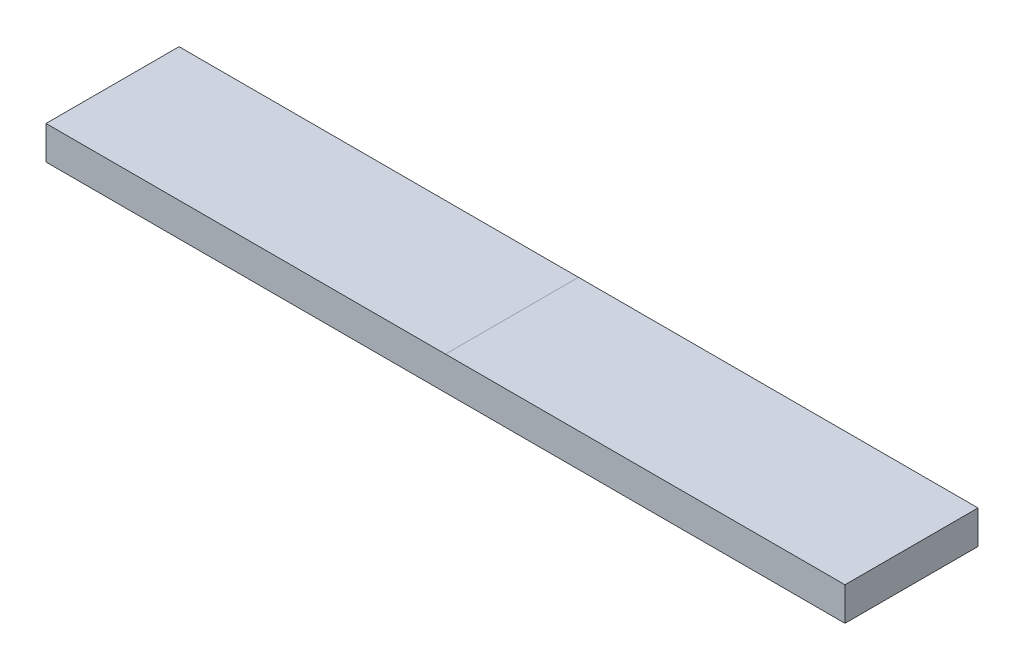
ISO-10303-21;
HEADER;
FILE_DESCRIPTION(('STEP AP214'),'2;1');
FILE_NAME('part.step','',(''),(''),'','','');
FILE_SCHEMA(('AUTOMOTIVE_DESIGN { 1 0 10303 214 1 1 1 1 }'));
ENDSEC;
DATA;
#1=APPLICATION_CONTEXT('core data for automotive mechanical design processes');
#2=APPLICATION_PROTOCOL_DEFINITION('international standard','automotive_design',2000,#1);
#3=PRODUCT_CONTEXT('',#1,'mechanical');
#4=PRODUCT('Part','Part','',(#3));
#5=PRODUCT_RELATED_PRODUCT_CATEGORY('part','',(#4));
#6=PRODUCT_DEFINITION_FORMATION('','',#4);
#7=PRODUCT_DEFINITION_CONTEXT('part definition',#1,'design');
#8=PRODUCT_DEFINITION('design','',#6,#7);
#9=PRODUCT_DEFINITION_SHAPE('','',#8);
#10=(LENGTH_UNIT() NAMED_UNIT(*) SI_UNIT(.MILLI.,.METRE.));
#11=(NAMED_UNIT(*) PLANE_ANGLE_UNIT() SI_UNIT($,.RADIAN.));
#12=(NAMED_UNIT(*) SI_UNIT($,.STERADIAN.) SOLID_ANGLE_UNIT());
#13=UNCERTAINTY_MEASURE_WITH_UNIT(LENGTH_MEASURE(1.E-05),#10,'distance_accuracy_value','');
#14=(GEOMETRIC_REPRESENTATION_CONTEXT(3) GLOBAL_UNCERTAINTY_ASSIGNED_CONTEXT((#13)) GLOBAL_UNIT_ASSIGNED_CONTEXT((#10,
#11,#12)) REPRESENTATION_CONTEXT('',''));
#15=CARTESIAN_POINT('',(0.,0.,0.));
#16=DIRECTION('',(0.,0.,1.));
#17=DIRECTION('',(1.,0.,0.));
#18=AXIS2_PLACEMENT_3D('',#15,#16,#17);
#19=CARTESIAN_POINT('',(76.2,3.1877,12.6873));
#20=DIRECTION('',(0.,1.,0.));
#21=DIRECTION('',(0.,0.,1.));
#22=AXIS2_PLACEMENT_3D('',#19,#20,#21);
#23=PLANE('',#22);
#24=DIRECTION('',(-1.,0.,0.));
#25=VECTOR('',#24,1.);
#26=CARTESIAN_POINT('',(76.2,3.1877,12.6873));
#27=LINE('',#26,#25);
#28=CARTESIAN_POINT('',(0.,3.1877,12.6873));
#29=VERTEX_POINT('',#28);
#30=CARTESIAN_POINT('',(-76.2,3.1877,12.6873));
#31=VERTEX_POINT('',#30);
#32=EDGE_CURVE('E104',#29,#31,#27,.T.);
#33=ORIENTED_EDGE('',*,*,#32,.F.);
#34=DIRECTION('',(0.,0.,-1.));
#35=VECTOR('',#34,1.);
#36=CARTESIAN_POINT('',(0.,3.1877,12.6873));
#37=LINE('',#36,#35);
#38=CARTESIAN_POINT('',(0.,3.1877,-12.6873));
#39=VERTEX_POINT('',#38);
#40=EDGE_CURVE('E12',#29,#39,#37,.T.);
#41=ORIENTED_EDGE('',*,*,#40,.T.);
#42=DIRECTION('',(-1.,0.,0.));
#43=VECTOR('',#42,1.);
#44=CARTESIAN_POINT('',(76.2,3.1877,-12.6873));
#45=LINE('',#44,#43);
#46=CARTESIAN_POINT('',(-76.2,3.1877,-12.6873));
#47=VERTEX_POINT('',#46);
#48=EDGE_CURVE('E103',#39,#47,#45,.T.);
#49=ORIENTED_EDGE('',*,*,#48,.T.);
#50=DIRECTION('',(0.,0.,-1.));
#51=VECTOR('',#50,1.);
#52=CARTESIAN_POINT('',(-76.2,3.1877,12.6873));
#53=LINE('',#52,#51);
#54=EDGE_CURVE('E131',#31,#47,#53,.T.);
#55=ORIENTED_EDGE('',*,*,#54,.F.);
#56=EDGE_LOOP('',(#33,#41,#49,#55));
#57=FACE_BOUND('',#56,.T.);
#58=ADVANCED_FACE('F43',(#57),#23,.T.);
#59=CARTESIAN_POINT('',(76.2,-3.1877,12.6873));
#60=DIRECTION('',(0.,1.,0.));
#61=DIRECTION('',(0.,0.,1.));
#62=AXIS2_PLACEMENT_3D('',#59,#60,#61);
#63=PLANE('',#62);
#64=DIRECTION('',(-1.,0.,0.));
#65=VECTOR('',#64,1.);
#66=CARTESIAN_POINT('',(76.2,-3.1877,12.6873));
#67=LINE('',#66,#65);
#68=CARTESIAN_POINT('',(63.5,-3.1877,12.6873));
#69=VERTEX_POINT('',#68);
#70=CARTESIAN_POINT('',(-63.4999999999999,-3.1877,12.6873));
#71=VERTEX_POINT('',#70);
#72=EDGE_CURVE('E138',#69,#71,#67,.T.);
#73=ORIENTED_EDGE('',*,*,#72,.T.);
#74=DIRECTION('',(0.,0.,-1.));
#75=VECTOR('',#74,1.);
#76=CARTESIAN_POINT('',(-63.5,-3.1877,12.6873));
#77=LINE('',#76,#75);
#78=CARTESIAN_POINT('',(-63.4999999999999,-3.1877,-12.6873));
#79=VERTEX_POINT('',#78);
#80=EDGE_CURVE('E51',#71,#79,#77,.T.);
#81=ORIENTED_EDGE('',*,*,#80,.T.);
#82=DIRECTION('',(-1.,0.,0.));
#83=VECTOR('',#82,1.);
#84=CARTESIAN_POINT('',(76.2,-3.1877,-12.6873));
#85=LINE('',#84,#83);
#86=CARTESIAN_POINT('',(63.5,-3.1877,-12.6873));
#87=VERTEX_POINT('',#86);
#88=EDGE_CURVE('E143',#87,#79,#85,.T.);
#89=ORIENTED_EDGE('',*,*,#88,.F.);
#90=DIRECTION('',(0.,0.,-1.));
#91=VECTOR('',#90,1.);
#92=CARTESIAN_POINT('',(63.5,-3.1877,12.6873));
#93=LINE('',#92,#91);
#94=EDGE_CURVE('E137',#69,#87,#93,.T.);
#95=ORIENTED_EDGE('',*,*,#94,.F.);
#96=EDGE_LOOP('',(#73,#81,#89,#95));
#97=FACE_BOUND('',#96,.T.);
#98=ADVANCED_FACE('F151',(#97),#63,.F.);
#99=CARTESIAN_POINT('',(76.2,-3.1877,12.6873));
#100=VERTEX_POINT('',#99);
#101=EDGE_CURVE('E117',#100,#69,#67,.T.);
#102=ORIENTED_EDGE('',*,*,#101,.T.);
#103=ORIENTED_EDGE('',*,*,#94,.T.);
#104=CARTESIAN_POINT('',(76.2,-3.1877,-12.6873));
#105=VERTEX_POINT('',#104);
#106=EDGE_CURVE('E140',#105,#87,#85,.T.);
#107=ORIENTED_EDGE('',*,*,#106,.F.);
#108=DIRECTION('',(0.,0.,-1.));
#109=VECTOR('',#108,1.);
#110=CARTESIAN_POINT('',(76.2,-3.1877,12.6873));
#111=LINE('',#110,#109);
#112=EDGE_CURVE('E126',#100,#105,#111,.T.);
#113=ORIENTED_EDGE('',*,*,#112,.F.);
#114=EDGE_LOOP('',(#102,#103,#107,#113));
#115=FACE_BOUND('',#114,.T.);
#116=ADVANCED_FACE('F162',(#115),#63,.F.);
#117=CARTESIAN_POINT('',(76.2,-3.1877,12.6873));
#118=DIRECTION('',(0.,0.,1.));
#119=DIRECTION('',(1.,0.,0.));
#120=AXIS2_PLACEMENT_3D('',#117,#118,#119);
#121=PLANE('',#120);
#122=DIRECTION('',(0.,1.,0.));
#123=VECTOR('',#122,1.);
#124=CARTESIAN_POINT('',(-76.2,-3.1877,12.6873));
#125=LINE('',#124,#123);
#126=CARTESIAN_POINT('',(-76.2,-3.1877,12.6873));
#127=VERTEX_POINT('',#126);
#128=EDGE_CURVE('E128',#127,#31,#125,.T.);
#129=ORIENTED_EDGE('',*,*,#128,.F.);
#130=EDGE_CURVE('E139',#71,#127,#67,.T.);
#131=ORIENTED_EDGE('',*,*,#130,.F.);
#132=ORIENTED_EDGE('',*,*,#72,.F.);
#133=ORIENTED_EDGE('',*,*,#101,.F.);
#134=DIRECTION('',(0.,1.,0.));
#135=VECTOR('',#134,1.);
#136=CARTESIAN_POINT('',(76.2,-3.1877,12.6873));
#137=LINE('',#136,#135);
#138=CARTESIAN_POINT('',(76.2,3.1877,12.6873));
#139=VERTEX_POINT('',#138);
#140=EDGE_CURVE('E109',#100,#139,#137,.T.);
#141=ORIENTED_EDGE('',*,*,#140,.T.);
#142=EDGE_CURVE('E97',#139,#29,#27,.T.);
#143=ORIENTED_EDGE('',*,*,#142,.T.);
#144=ORIENTED_EDGE('',*,*,#32,.T.);
#145=EDGE_LOOP('',(#129,#131,#132,#133,#141,#143,#144));
#146=FACE_BOUND('',#145,.T.);
#147=ADVANCED_FACE('F45',(#146),#121,.T.);
#148=ORIENTED_EDGE('',*,*,#80,.F.);
#149=ORIENTED_EDGE('',*,*,#130,.T.);
#150=DIRECTION('',(0.,0.,-1.));
#151=VECTOR('',#150,1.);
#152=CARTESIAN_POINT('',(-76.2,-3.1877,12.6873));
#153=LINE('',#152,#151);
#154=CARTESIAN_POINT('',(-76.2,-3.1877,-12.6873));
#155=VERTEX_POINT('',#154);
#156=EDGE_CURVE('E119',#127,#155,#153,.T.);
#157=ORIENTED_EDGE('',*,*,#156,.T.);
#158=EDGE_CURVE('E144',#79,#155,#85,.T.);
#159=ORIENTED_EDGE('',*,*,#158,.F.);
#160=EDGE_LOOP('',(#148,#149,#157,#159));
#161=FACE_BOUND('',#160,.T.);
#162=ADVANCED_FACE('F155',(#161),#63,.F.);
#163=CARTESIAN_POINT('',(76.2,-3.1877,-12.6873));
#164=DIRECTION('',(0.,0.,1.));
#165=DIRECTION('',(1.,0.,0.));
#166=AXIS2_PLACEMENT_3D('',#163,#164,#165);
#167=PLANE('',#166);
#168=DIRECTION('',(0.,1.,0.));
#169=VECTOR('',#168,1.);
#170=CARTESIAN_POINT('',(-76.2,-3.1877,-12.6873));
#171=LINE('',#170,#169);
#172=EDGE_CURVE('E122',#155,#47,#171,.T.);
#173=ORIENTED_EDGE('',*,*,#172,.T.);
#174=ORIENTED_EDGE('',*,*,#48,.F.);
#175=CARTESIAN_POINT('',(76.2,3.1877,-12.6873));
#176=VERTEX_POINT('',#175);
#177=EDGE_CURVE('E145',#176,#39,#45,.T.);
#178=ORIENTED_EDGE('',*,*,#177,.F.);
#179=DIRECTION('',(0.,1.,0.));
#180=VECTOR('',#179,1.);
#181=CARTESIAN_POINT('',(76.2,-3.1877,-12.6873));
#182=LINE('',#181,#180);
#183=EDGE_CURVE('E111',#105,#176,#182,.T.);
#184=ORIENTED_EDGE('',*,*,#183,.F.);
#185=ORIENTED_EDGE('',*,*,#106,.T.);
#186=ORIENTED_EDGE('',*,*,#88,.T.);
#187=ORIENTED_EDGE('',*,*,#158,.T.);
#188=EDGE_LOOP('',(#173,#174,#178,#184,#185,#186,#187));
#189=FACE_BOUND('',#188,.T.);
#190=ADVANCED_FACE('F159',(#189),#167,.F.);
#191=ORIENTED_EDGE('',*,*,#40,.F.);
#192=ORIENTED_EDGE('',*,*,#142,.F.);
#193=DIRECTION('',(0.,0.,-1.));
#194=VECTOR('',#193,1.);
#195=CARTESIAN_POINT('',(76.2,3.1877,12.6873));
#196=LINE('',#195,#194);
#197=EDGE_CURVE('E100',#139,#176,#196,.T.);
#198=ORIENTED_EDGE('',*,*,#197,.T.);
#199=ORIENTED_EDGE('',*,*,#177,.T.);
#200=EDGE_LOOP('',(#191,#192,#198,#199));
#201=FACE_BOUND('',#200,.T.);
#202=ADVANCED_FACE('F99',(#201),#23,.T.);
#203=CARTESIAN_POINT('',(76.2,0.,0.));
#204=DIRECTION('',(-1.,0.,0.));
#205=DIRECTION('',(0.,0.,1.));
#206=AXIS2_PLACEMENT_3D('',#203,#204,#205);
#207=PLANE('',#206);
#208=ORIENTED_EDGE('',*,*,#140,.F.);
#209=ORIENTED_EDGE('',*,*,#112,.T.);
#210=ORIENTED_EDGE('',*,*,#183,.T.);
#211=ORIENTED_EDGE('',*,*,#197,.F.);
#212=EDGE_LOOP('',(#208,#209,#210,#211));
#213=FACE_BOUND('',#212,.T.);
#214=ADVANCED_FACE('F108',(#213),#207,.F.);
#215=CARTESIAN_POINT('',(-76.2,0.,0.));
#216=DIRECTION('',(-1.,0.,0.));
#217=DIRECTION('',(0.,0.,1.));
#218=AXIS2_PLACEMENT_3D('',#215,#216,#217);
#219=PLANE('',#218);
#220=ORIENTED_EDGE('',*,*,#128,.T.);
#221=ORIENTED_EDGE('',*,*,#54,.T.);
#222=ORIENTED_EDGE('',*,*,#172,.F.);
#223=ORIENTED_EDGE('',*,*,#156,.F.);
#224=EDGE_LOOP('',(#220,#221,#222,#223));
#225=FACE_BOUND('',#224,.T.);
#226=ADVANCED_FACE('F164',(#225),#219,.T.);
#227=CLOSED_SHELL('',(#58,#98,#116,#147,#162,#190,#202,#214,#226));
#228=MANIFOLD_SOLID_BREP('B2',#227);
#229=ADVANCED_BREP_SHAPE_REPRESENTATION('',(#18,#228),#14);
#230=SHAPE_DEFINITION_REPRESENTATION(#9,#229);
ENDSEC;
END-ISO-10303-21;
